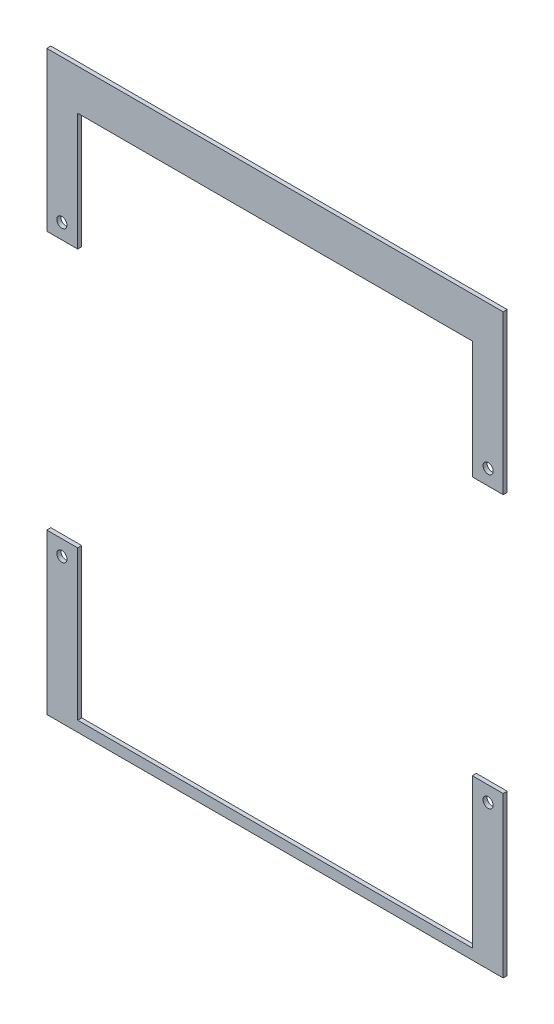
ISO-10303-21;
HEADER;
FILE_DESCRIPTION(('STEP AP214'),'2;1');
FILE_NAME('part.step','',(''),(''),'','','');
FILE_SCHEMA(('AUTOMOTIVE_DESIGN { 1 0 10303 214 1 1 1 1 }'));
ENDSEC;
DATA;
#1=APPLICATION_CONTEXT('core data for automotive mechanical design processes');
#2=APPLICATION_PROTOCOL_DEFINITION('international standard','automotive_design',2000,#1);
#3=PRODUCT_CONTEXT('',#1,'mechanical');
#4=PRODUCT('Part','Part','',(#3));
#5=PRODUCT_RELATED_PRODUCT_CATEGORY('part','',(#4));
#6=PRODUCT_DEFINITION_FORMATION('','',#4);
#7=PRODUCT_DEFINITION_CONTEXT('part definition',#1,'design');
#8=PRODUCT_DEFINITION('design','',#6,#7);
#9=PRODUCT_DEFINITION_SHAPE('','',#8);
#10=(LENGTH_UNIT() NAMED_UNIT(*) SI_UNIT(.MILLI.,.METRE.));
#11=(NAMED_UNIT(*) PLANE_ANGLE_UNIT() SI_UNIT($,.RADIAN.));
#12=(NAMED_UNIT(*) SI_UNIT($,.STERADIAN.) SOLID_ANGLE_UNIT());
#13=UNCERTAINTY_MEASURE_WITH_UNIT(LENGTH_MEASURE(1.E-05),#10,'distance_accuracy_value','');
#14=(GEOMETRIC_REPRESENTATION_CONTEXT(3) GLOBAL_UNCERTAINTY_ASSIGNED_CONTEXT((#13)) GLOBAL_UNIT_ASSIGNED_CONTEXT((#10,
#11,#12)) REPRESENTATION_CONTEXT('',''));
#15=CARTESIAN_POINT('',(0.,0.,0.));
#16=DIRECTION('',(0.,0.,1.));
#17=DIRECTION('',(1.,0.,0.));
#18=AXIS2_PLACEMENT_3D('',#15,#16,#17);
#19=CARTESIAN_POINT('',(0.,-44.6224,1.5875));
#20=DIRECTION('',(0.,1.,0.));
#21=DIRECTION('',(0.,0.,1.));
#22=AXIS2_PLACEMENT_3D('',#19,#20,#21);
#23=PLANE('',#22);
#24=DIRECTION('',(1.,0.,0.));
#25=VECTOR('',#24,1.);
#26=CARTESIAN_POINT('',(0.,-44.6224,0.));
#27=LINE('',#26,#25);
#28=CARTESIAN_POINT('',(-89.6514,-44.6224,0.));
#29=VERTEX_POINT('',#28);
#30=CARTESIAN_POINT('',(-77.5,-44.6224,0.));
#31=VERTEX_POINT('',#30);
#32=EDGE_CURVE('E179',#29,#31,#27,.T.);
#33=ORIENTED_EDGE('',*,*,#32,.F.);
#34=DIRECTION('',(0.,0.,-1.));
#35=VECTOR('',#34,1.);
#36=CARTESIAN_POINT('',(-89.6514,-44.6224,1.5875));
#37=LINE('',#36,#35);
#38=CARTESIAN_POINT('',(-89.6514,-44.6224,1.5875));
#39=VERTEX_POINT('',#38);
#40=EDGE_CURVE('E12',#39,#29,#37,.T.);
#41=ORIENTED_EDGE('',*,*,#40,.F.);
#42=DIRECTION('',(1.,0.,0.));
#43=VECTOR('',#42,1.);
#44=CARTESIAN_POINT('',(0.,-44.6224,1.5875));
#45=LINE('',#44,#43);
#46=CARTESIAN_POINT('',(-77.5,-44.6224,1.5875));
#47=VERTEX_POINT('',#46);
#48=EDGE_CURVE('E167',#39,#47,#45,.T.);
#49=ORIENTED_EDGE('',*,*,#48,.T.);
#50=DIRECTION('',(0.,0.,-1.));
#51=VECTOR('',#50,1.);
#52=CARTESIAN_POINT('',(-77.5,-44.6224,1.5875));
#53=LINE('',#52,#51);
#54=EDGE_CURVE('E64',#47,#31,#53,.T.);
#55=ORIENTED_EDGE('',*,*,#54,.T.);
#56=EDGE_LOOP('',(#33,#41,#49,#55));
#57=FACE_BOUND('',#56,.T.);
#58=ADVANCED_FACE('F47',(#57),#23,.T.);
#59=CARTESIAN_POINT('',(-89.6514,0.,1.5875));
#60=DIRECTION('',(1.,0.,0.));
#61=DIRECTION('',(0.,1.,0.));
#62=AXIS2_PLACEMENT_3D('',#59,#60,#61);
#63=PLANE('',#62);
#64=DIRECTION('',(0.,-1.,0.));
#65=VECTOR('',#64,1.);
#66=CARTESIAN_POINT('',(-89.6514,0.,0.));
#67=LINE('',#66,#65);
#68=CARTESIAN_POINT('',(-89.6514,-107.38,0.));
#69=VERTEX_POINT('',#68);
#70=EDGE_CURVE('E181',#29,#69,#67,.T.);
#71=ORIENTED_EDGE('',*,*,#70,.T.);
#72=DIRECTION('',(0.,0.,-1.));
#73=VECTOR('',#72,1.);
#74=CARTESIAN_POINT('',(-89.6514,-107.38,1.5875));
#75=LINE('',#74,#73);
#76=CARTESIAN_POINT('',(-89.6514,-107.38,1.5875));
#77=VERTEX_POINT('',#76);
#78=EDGE_CURVE('E56',#77,#69,#75,.T.);
#79=ORIENTED_EDGE('',*,*,#78,.F.);
#80=DIRECTION('',(0.,-1.,0.));
#81=VECTOR('',#80,1.);
#82=CARTESIAN_POINT('',(-89.6514,0.,1.5875));
#83=LINE('',#82,#81);
#84=EDGE_CURVE('E170',#39,#77,#83,.T.);
#85=ORIENTED_EDGE('',*,*,#84,.F.);
#86=ORIENTED_EDGE('',*,*,#40,.T.);
#87=EDGE_LOOP('',(#71,#79,#85,#86));
#88=FACE_BOUND('',#87,.T.);
#89=ADVANCED_FACE('F197',(#88),#63,.F.);
#90=CARTESIAN_POINT('',(0.,-107.38,1.5875));
#91=DIRECTION('',(0.,1.,0.));
#92=DIRECTION('',(0.,0.,1.));
#93=AXIS2_PLACEMENT_3D('',#90,#91,#92);
#94=PLANE('',#93);
#95=DIRECTION('',(1.,0.,0.));
#96=VECTOR('',#95,1.);
#97=CARTESIAN_POINT('',(0.,-107.38,0.));
#98=LINE('',#97,#96);
#99=CARTESIAN_POINT('',(89.6514,-107.38,0.));
#100=VERTEX_POINT('',#99);
#101=EDGE_CURVE('E184',#69,#100,#98,.T.);
#102=ORIENTED_EDGE('',*,*,#101,.T.);
#103=DIRECTION('',(0.,0.,-1.));
#104=VECTOR('',#103,1.);
#105=CARTESIAN_POINT('',(89.6514,-107.38,1.5875));
#106=LINE('',#105,#104);
#107=CARTESIAN_POINT('',(89.6514,-107.38,1.5875));
#108=VERTEX_POINT('',#107);
#109=EDGE_CURVE('E139',#108,#100,#106,.T.);
#110=ORIENTED_EDGE('',*,*,#109,.F.);
#111=DIRECTION('',(1.,0.,0.));
#112=VECTOR('',#111,1.);
#113=CARTESIAN_POINT('',(0.,-107.38,1.5875));
#114=LINE('',#113,#112);
#115=EDGE_CURVE('E124',#77,#108,#114,.T.);
#116=ORIENTED_EDGE('',*,*,#115,.F.);
#117=ORIENTED_EDGE('',*,*,#78,.T.);
#118=EDGE_LOOP('',(#102,#110,#116,#117));
#119=FACE_BOUND('',#118,.T.);
#120=ADVANCED_FACE('F194',(#119),#94,.F.);
#121=CARTESIAN_POINT('',(0.,-103.25,1.5875));
#122=DIRECTION('',(0.,1.,0.));
#123=DIRECTION('',(0.,0.,1.));
#124=AXIS2_PLACEMENT_3D('',#121,#122,#123);
#125=PLANE('',#124);
#126=DIRECTION('',(1.,0.,0.));
#127=VECTOR('',#126,1.);
#128=CARTESIAN_POINT('',(0.,-103.25,0.));
#129=LINE('',#128,#127);
#130=CARTESIAN_POINT('',(-77.5,-103.25,0.));
#131=VERTEX_POINT('',#130);
#132=CARTESIAN_POINT('',(77.5,-103.25,0.));
#133=VERTEX_POINT('',#132);
#134=EDGE_CURVE('E186',#131,#133,#129,.T.);
#135=ORIENTED_EDGE('',*,*,#134,.F.);
#136=DIRECTION('',(0.,0.,-1.));
#137=VECTOR('',#136,1.);
#138=CARTESIAN_POINT('',(-77.5,-103.25,1.5875));
#139=LINE('',#138,#137);
#140=CARTESIAN_POINT('',(-77.5,-103.25,1.5875));
#141=VERTEX_POINT('',#140);
#142=EDGE_CURVE('E78',#141,#131,#139,.T.);
#143=ORIENTED_EDGE('',*,*,#142,.F.);
#144=DIRECTION('',(1.,0.,0.));
#145=VECTOR('',#144,1.);
#146=CARTESIAN_POINT('',(0.,-103.25,1.5875));
#147=LINE('',#146,#145);
#148=CARTESIAN_POINT('',(77.5,-103.25,1.5875));
#149=VERTEX_POINT('',#148);
#150=EDGE_CURVE('E173',#141,#149,#147,.T.);
#151=ORIENTED_EDGE('',*,*,#150,.T.);
#152=DIRECTION('',(0.,0.,-1.));
#153=VECTOR('',#152,1.);
#154=CARTESIAN_POINT('',(77.5,-103.25,1.5875));
#155=LINE('',#154,#153);
#156=EDGE_CURVE('E160',#149,#133,#155,.T.);
#157=ORIENTED_EDGE('',*,*,#156,.T.);
#158=EDGE_LOOP('',(#135,#143,#151,#157));
#159=FACE_BOUND('',#158,.T.);
#160=ADVANCED_FACE('F209',(#159),#125,.T.);
#161=CARTESIAN_POINT('',(-83.72,-50.6224,1.5875));
#162=DIRECTION('',(0.,0.,-1.));
#163=DIRECTION('',(-1.,0.,0.));
#164=AXIS2_PLACEMENT_3D('',#161,#162,#163);
#165=CYLINDRICAL_SURFACE('',#164,2.);
#166=CARTESIAN_POINT('',(-83.72,-50.6224,1.5875));
#167=DIRECTION('',(0.,0.,1.));
#168=DIRECTION('',(1.,0.,0.));
#169=AXIS2_PLACEMENT_3D('',#166,#167,#168);
#170=CIRCLE('',#169,2.);
#171=CARTESIAN_POINT('',(-81.72,-50.6224,1.5875));
#172=VERTEX_POINT('',#171);
#173=EDGE_CURVE('E164',#172,#172,#170,.T.);
#174=ORIENTED_EDGE('',*,*,#173,.T.);
#175=EDGE_LOOP('',(#174));
#176=FACE_BOUND('',#175,.T.);
#177=CARTESIAN_POINT('',(-83.72,-50.6224,0.));
#178=DIRECTION('',(0.,0.,1.));
#179=DIRECTION('',(1.,0.,0.));
#180=AXIS2_PLACEMENT_3D('',#177,#178,#179);
#181=CIRCLE('',#180,2.);
#182=CARTESIAN_POINT('',(-81.72,-50.6224,0.));
#183=VERTEX_POINT('',#182);
#184=EDGE_CURVE('E138',#183,#183,#181,.T.);
#185=ORIENTED_EDGE('',*,*,#184,.F.);
#186=EDGE_LOOP('',(#185));
#187=FACE_BOUND('',#186,.T.);
#188=ADVANCED_FACE('F49',(#176,#187),#165,.F.);
#189=CARTESIAN_POINT('',(-77.5,0.,1.5875));
#190=DIRECTION('',(1.,0.,0.));
#191=DIRECTION('',(0.,1.,0.));
#192=AXIS2_PLACEMENT_3D('',#189,#190,#191);
#193=PLANE('',#192);
#194=DIRECTION('',(0.,-1.,0.));
#195=VECTOR('',#194,1.);
#196=CARTESIAN_POINT('',(-77.5,0.,0.));
#197=LINE('',#196,#195);
#198=EDGE_CURVE('E168',#31,#131,#197,.T.);
#199=ORIENTED_EDGE('',*,*,#198,.F.);
#200=ORIENTED_EDGE('',*,*,#54,.F.);
#201=DIRECTION('',(0.,-1.,0.));
#202=VECTOR('',#201,1.);
#203=CARTESIAN_POINT('',(-77.5,0.,1.5875));
#204=LINE('',#203,#202);
#205=EDGE_CURVE('E175',#47,#141,#204,.T.);
#206=ORIENTED_EDGE('',*,*,#205,.T.);
#207=ORIENTED_EDGE('',*,*,#142,.T.);
#208=EDGE_LOOP('',(#199,#200,#206,#207));
#209=FACE_BOUND('',#208,.T.);
#210=ADVANCED_FACE('F213',(#209),#193,.T.);
#211=CARTESIAN_POINT('',(0.,0.,1.5875));
#212=DIRECTION('',(0.,0.,1.));
#213=DIRECTION('',(1.,0.,0.));
#214=AXIS2_PLACEMENT_3D('',#211,#212,#213);
#215=PLANE('',#214);
#216=ORIENTED_EDGE('',*,*,#173,.F.);
#217=EDGE_LOOP('',(#216));
#218=FACE_BOUND('',#217,.T.);
#219=ORIENTED_EDGE('',*,*,#48,.F.);
#220=ORIENTED_EDGE('',*,*,#84,.T.);
#221=ORIENTED_EDGE('',*,*,#115,.T.);
#222=DIRECTION('',(0.,-1.,0.));
#223=VECTOR('',#222,1.);
#224=CARTESIAN_POINT('',(89.6514,0.,1.5875));
#225=LINE('',#224,#223);
#226=CARTESIAN_POINT('',(89.6514,-44.6224,1.5875));
#227=VERTEX_POINT('',#226);
#228=EDGE_CURVE('E114',#227,#108,#225,.T.);
#229=ORIENTED_EDGE('',*,*,#228,.F.);
#230=DIRECTION('',(-1.,0.,0.));
#231=VECTOR('',#230,1.);
#232=CARTESIAN_POINT('',(0.,-44.6224,1.5875));
#233=LINE('',#232,#231);
#234=CARTESIAN_POINT('',(77.5,-44.6224,1.5875));
#235=VERTEX_POINT('',#234);
#236=EDGE_CURVE('E121',#227,#235,#233,.T.);
#237=ORIENTED_EDGE('',*,*,#236,.T.);
#238=DIRECTION('',(0.,-1.,0.));
#239=VECTOR('',#238,1.);
#240=CARTESIAN_POINT('',(77.5,0.,1.5875));
#241=LINE('',#240,#239);
#242=EDGE_CURVE('E128',#235,#149,#241,.T.);
#243=ORIENTED_EDGE('',*,*,#242,.T.);
#244=ORIENTED_EDGE('',*,*,#150,.F.);
#245=ORIENTED_EDGE('',*,*,#205,.F.);
#246=EDGE_LOOP('',(#219,#220,#221,#229,#237,#243,#244,#245));
#247=FACE_BOUND('',#246,.T.);
#248=CARTESIAN_POINT('',(83.72,-50.6224,1.5875));
#249=DIRECTION('',(0.,0.,-1.));
#250=DIRECTION('',(-1.,0.,0.));
#251=AXIS2_PLACEMENT_3D('',#248,#249,#250);
#252=CIRCLE('',#251,2.);
#253=CARTESIAN_POINT('',(81.72,-50.6224,1.5875));
#254=VERTEX_POINT('',#253);
#255=EDGE_CURVE('E144',#254,#254,#252,.T.);
#256=ORIENTED_EDGE('',*,*,#255,.T.);
#257=EDGE_LOOP('',(#256));
#258=FACE_BOUND('',#257,.T.);
#259=ADVANCED_FACE('F117',(#218,#247,#258),#215,.T.);
#260=CARTESIAN_POINT('',(0.,0.,0.));
#261=DIRECTION('',(0.,0.,1.));
#262=DIRECTION('',(1.,0.,0.));
#263=AXIS2_PLACEMENT_3D('',#260,#261,#262);
#264=PLANE('',#263);
#265=ORIENTED_EDGE('',*,*,#184,.T.);
#266=EDGE_LOOP('',(#265));
#267=FACE_BOUND('',#266,.T.);
#268=ORIENTED_EDGE('',*,*,#32,.T.);
#269=ORIENTED_EDGE('',*,*,#198,.T.);
#270=ORIENTED_EDGE('',*,*,#134,.T.);
#271=DIRECTION('',(0.,-1.,0.));
#272=VECTOR('',#271,1.);
#273=CARTESIAN_POINT('',(77.5,0.,0.));
#274=LINE('',#273,#272);
#275=CARTESIAN_POINT('',(77.5,-44.6224,0.));
#276=VERTEX_POINT('',#275);
#277=EDGE_CURVE('E147',#276,#133,#274,.T.);
#278=ORIENTED_EDGE('',*,*,#277,.F.);
#279=DIRECTION('',(-1.,0.,0.));
#280=VECTOR('',#279,1.);
#281=CARTESIAN_POINT('',(0.,-44.6224,0.));
#282=LINE('',#281,#280);
#283=CARTESIAN_POINT('',(89.6514,-44.6224,0.));
#284=VERTEX_POINT('',#283);
#285=EDGE_CURVE('E154',#284,#276,#282,.T.);
#286=ORIENTED_EDGE('',*,*,#285,.F.);
#287=DIRECTION('',(0.,-1.,0.));
#288=VECTOR('',#287,1.);
#289=CARTESIAN_POINT('',(89.6514,0.,0.));
#290=LINE('',#289,#288);
#291=EDGE_CURVE('E134',#284,#100,#290,.T.);
#292=ORIENTED_EDGE('',*,*,#291,.T.);
#293=ORIENTED_EDGE('',*,*,#101,.F.);
#294=ORIENTED_EDGE('',*,*,#70,.F.);
#295=EDGE_LOOP('',(#268,#269,#270,#278,#286,#292,#293,#294));
#296=FACE_BOUND('',#295,.T.);
#297=CARTESIAN_POINT('',(83.72,-50.6224,0.));
#298=DIRECTION('',(0.,0.,-1.));
#299=DIRECTION('',(-1.,0.,0.));
#300=AXIS2_PLACEMENT_3D('',#297,#298,#299);
#301=CIRCLE('',#300,2.);
#302=CARTESIAN_POINT('',(81.72,-50.6224,0.));
#303=VERTEX_POINT('',#302);
#304=EDGE_CURVE('E151',#303,#303,#301,.T.);
#305=ORIENTED_EDGE('',*,*,#304,.F.);
#306=EDGE_LOOP('',(#305));
#307=FACE_BOUND('',#306,.T.);
#308=ADVANCED_FACE('F199',(#267,#296,#307),#264,.F.);
#309=CARTESIAN_POINT('',(0.,-44.6224,1.5875));
#310=DIRECTION('',(0.,1.,0.));
#311=DIRECTION('',(0.,0.,1.));
#312=AXIS2_PLACEMENT_3D('',#309,#310,#311);
#313=PLANE('',#312);
#314=ORIENTED_EDGE('',*,*,#285,.T.);
#315=DIRECTION('',(0.,0.,-1.));
#316=VECTOR('',#315,1.);
#317=CARTESIAN_POINT('',(77.5,-44.6224,1.5875));
#318=LINE('',#317,#316);
#319=EDGE_CURVE('E143',#235,#276,#318,.T.);
#320=ORIENTED_EDGE('',*,*,#319,.F.);
#321=ORIENTED_EDGE('',*,*,#236,.F.);
#322=DIRECTION('',(0.,0.,-1.));
#323=VECTOR('',#322,1.);
#324=CARTESIAN_POINT('',(89.6514,-44.6224,1.5875));
#325=LINE('',#324,#323);
#326=EDGE_CURVE('E131',#227,#284,#325,.T.);
#327=ORIENTED_EDGE('',*,*,#326,.T.);
#328=EDGE_LOOP('',(#314,#320,#321,#327));
#329=FACE_BOUND('',#328,.T.);
#330=ADVANCED_FACE('F141',(#329),#313,.T.);
#331=CARTESIAN_POINT('',(89.6514,0.,1.5875));
#332=DIRECTION('',(-1.,0.,0.));
#333=DIRECTION('',(0.,1.,0.));
#334=AXIS2_PLACEMENT_3D('',#331,#332,#333);
#335=PLANE('',#334);
#336=ORIENTED_EDGE('',*,*,#291,.F.);
#337=ORIENTED_EDGE('',*,*,#326,.F.);
#338=ORIENTED_EDGE('',*,*,#228,.T.);
#339=ORIENTED_EDGE('',*,*,#109,.T.);
#340=EDGE_LOOP('',(#336,#337,#338,#339));
#341=FACE_BOUND('',#340,.T.);
#342=ADVANCED_FACE('F132',(#341),#335,.F.);
#343=CARTESIAN_POINT('',(83.72,-50.6224,1.5875));
#344=DIRECTION('',(0.,0.,-1.));
#345=DIRECTION('',(1.,0.,0.));
#346=AXIS2_PLACEMENT_3D('',#343,#344,#345);
#347=CYLINDRICAL_SURFACE('',#346,2.);
#348=ORIENTED_EDGE('',*,*,#255,.F.);
#349=EDGE_LOOP('',(#348));
#350=FACE_BOUND('',#349,.T.);
#351=ORIENTED_EDGE('',*,*,#304,.T.);
#352=EDGE_LOOP('',(#351));
#353=FACE_BOUND('',#352,.T.);
#354=ADVANCED_FACE('F222',(#350,#353),#347,.F.);
#355=CARTESIAN_POINT('',(77.5,0.,1.5875));
#356=DIRECTION('',(-1.,0.,0.));
#357=DIRECTION('',(0.,1.,0.));
#358=AXIS2_PLACEMENT_3D('',#355,#356,#357);
#359=PLANE('',#358);
#360=ORIENTED_EDGE('',*,*,#277,.T.);
#361=ORIENTED_EDGE('',*,*,#156,.F.);
#362=ORIENTED_EDGE('',*,*,#242,.F.);
#363=ORIENTED_EDGE('',*,*,#319,.T.);
#364=EDGE_LOOP('',(#360,#361,#362,#363));
#365=FACE_BOUND('',#364,.T.);
#366=ADVANCED_FACE('F225',(#365),#359,.T.);
#367=CLOSED_SHELL('',(#58,#89,#120,#160,#188,#210,#259,#308,#330,#342,#354,#366));
#368=MANIFOLD_SOLID_BREP('B2',#367);
#369=CARTESIAN_POINT('',(-89.6514,0.,1.5875));
#370=DIRECTION('',(1.,0.,0.));
#371=DIRECTION('',(0.,1.,0.));
#372=AXIS2_PLACEMENT_3D('',#369,#370,#371);
#373=PLANE('',#372);
#374=DIRECTION('',(0.,-1.,0.));
#375=VECTOR('',#374,1.);
#376=CARTESIAN_POINT('',(-89.6514,0.,0.));
#377=LINE('',#376,#375);
#378=CARTESIAN_POINT('',(-89.6514,119.25,0.));
#379=VERTEX_POINT('',#378);
#380=CARTESIAN_POINT('',(-89.6514,57.03,0.));
#381=VERTEX_POINT('',#380);
#382=EDGE_CURVE('E452',#379,#381,#377,.T.);
#383=ORIENTED_EDGE('',*,*,#382,.T.);
#384=DIRECTION('',(0.,0.,-1.));
#385=VECTOR('',#384,1.);
#386=CARTESIAN_POINT('',(-89.6514,57.03,1.5875));
#387=LINE('',#386,#385);
#388=CARTESIAN_POINT('',(-89.6514,57.03,1.5875));
#389=VERTEX_POINT('',#388);
#390=EDGE_CURVE('E45',#389,#381,#387,.T.);
#391=ORIENTED_EDGE('',*,*,#390,.F.);
#392=DIRECTION('',(0.,-1.,0.));
#393=VECTOR('',#392,1.);
#394=CARTESIAN_POINT('',(-89.6514,0.,1.5875));
#395=LINE('',#394,#393);
#396=CARTESIAN_POINT('',(-89.6514,119.25,1.5875));
#397=VERTEX_POINT('',#396);
#398=EDGE_CURVE('E439',#397,#389,#395,.T.);
#399=ORIENTED_EDGE('',*,*,#398,.F.);
#400=DIRECTION('',(0.,0.,-1.));
#401=VECTOR('',#400,1.);
#402=CARTESIAN_POINT('',(-89.6514,119.25,1.5875));
#403=LINE('',#402,#401);
#404=EDGE_CURVE('E334',#397,#379,#403,.T.);
#405=ORIENTED_EDGE('',*,*,#404,.T.);
#406=EDGE_LOOP('',(#383,#391,#399,#405));
#407=FACE_BOUND('',#406,.T.);
#408=ADVANCED_FACE('F317',(#407),#373,.F.);
#409=CARTESIAN_POINT('',(0.,57.03,1.5875));
#410=DIRECTION('',(0.,1.,0.));
#411=DIRECTION('',(0.,0.,1.));
#412=AXIS2_PLACEMENT_3D('',#409,#410,#411);
#413=PLANE('',#412);
#414=DIRECTION('',(1.,0.,0.));
#415=VECTOR('',#414,1.);
#416=CARTESIAN_POINT('',(0.,57.03,0.));
#417=LINE('',#416,#415);
#418=CARTESIAN_POINT('',(-77.5,57.03,0.));
#419=VERTEX_POINT('',#418);
#420=EDGE_CURVE('E454',#381,#419,#417,.T.);
#421=ORIENTED_EDGE('',*,*,#420,.T.);
#422=DIRECTION('',(0.,0.,-1.));
#423=VECTOR('',#422,1.);
#424=CARTESIAN_POINT('',(-77.5,57.03,1.5875));
#425=LINE('',#424,#423);
#426=CARTESIAN_POINT('',(-77.5,57.03,1.5875));
#427=VERTEX_POINT('',#426);
#428=EDGE_CURVE('E326',#427,#419,#425,.T.);
#429=ORIENTED_EDGE('',*,*,#428,.F.);
#430=DIRECTION('',(1.,0.,0.));
#431=VECTOR('',#430,1.);
#432=CARTESIAN_POINT('',(0.,57.03,1.5875));
#433=LINE('',#432,#431);
#434=EDGE_CURVE('E363',#389,#427,#433,.T.);
#435=ORIENTED_EDGE('',*,*,#434,.F.);
#436=ORIENTED_EDGE('',*,*,#390,.T.);
#437=EDGE_LOOP('',(#421,#429,#435,#436));
#438=FACE_BOUND('',#437,.T.);
#439=ADVANCED_FACE('F468',(#438),#413,.F.);
#440=CARTESIAN_POINT('',(-77.5,0.,1.5875));
#441=DIRECTION('',(1.,0.,0.));
#442=DIRECTION('',(0.,1.,0.));
#443=AXIS2_PLACEMENT_3D('',#440,#441,#442);
#444=PLANE('',#443);
#445=DIRECTION('',(0.,-1.,0.));
#446=VECTOR('',#445,1.);
#447=CARTESIAN_POINT('',(-77.5,0.,0.));
#448=LINE('',#447,#446);
#449=CARTESIAN_POINT('',(-77.5,103.25,0.));
#450=VERTEX_POINT('',#449);
#451=EDGE_CURVE('E457',#450,#419,#448,.T.);
#452=ORIENTED_EDGE('',*,*,#451,.F.);
#453=DIRECTION('',(0.,0.,-1.));
#454=VECTOR('',#453,1.);
#455=CARTESIAN_POINT('',(-77.5,103.25,1.5875));
#456=LINE('',#455,#454);
#457=CARTESIAN_POINT('',(-77.5,103.25,1.5875));
#458=VERTEX_POINT('',#457);
#459=EDGE_CURVE('E352',#458,#450,#456,.T.);
#460=ORIENTED_EDGE('',*,*,#459,.F.);
#461=DIRECTION('',(0.,-1.,0.));
#462=VECTOR('',#461,1.);
#463=CARTESIAN_POINT('',(-77.5,0.,1.5875));
#464=LINE('',#463,#462);
#465=EDGE_CURVE('E443',#458,#427,#464,.T.);
#466=ORIENTED_EDGE('',*,*,#465,.T.);
#467=ORIENTED_EDGE('',*,*,#428,.T.);
#468=EDGE_LOOP('',(#452,#460,#466,#467));
#469=FACE_BOUND('',#468,.T.);
#470=ADVANCED_FACE('F466',(#469),#444,.T.);
#471=CARTESIAN_POINT('',(0.,103.25,1.5875));
#472=DIRECTION('',(0.,1.,0.));
#473=DIRECTION('',(0.,0.,1.));
#474=AXIS2_PLACEMENT_3D('',#471,#472,#473);
#475=PLANE('',#474);
#476=DIRECTION('',(1.,0.,0.));
#477=VECTOR('',#476,1.);
#478=CARTESIAN_POINT('',(0.,103.25,0.));
#479=LINE('',#478,#477);
#480=CARTESIAN_POINT('',(77.5,103.25,0.));
#481=VERTEX_POINT('',#480);
#482=EDGE_CURVE('E460',#450,#481,#479,.T.);
#483=ORIENTED_EDGE('',*,*,#482,.T.);
#484=DIRECTION('',(0.,0.,-1.));
#485=VECTOR('',#484,1.);
#486=CARTESIAN_POINT('',(77.5,103.25,1.5875));
#487=LINE('',#486,#485);
#488=CARTESIAN_POINT('',(77.5,103.25,1.5875));
#489=VERTEX_POINT('',#488);
#490=EDGE_CURVE('E432',#489,#481,#487,.T.);
#491=ORIENTED_EDGE('',*,*,#490,.F.);
#492=DIRECTION('',(1.,0.,0.));
#493=VECTOR('',#492,1.);
#494=CARTESIAN_POINT('',(0.,103.25,1.5875));
#495=LINE('',#494,#493);
#496=EDGE_CURVE('E446',#458,#489,#495,.T.);
#497=ORIENTED_EDGE('',*,*,#496,.F.);
#498=ORIENTED_EDGE('',*,*,#459,.T.);
#499=EDGE_LOOP('',(#483,#491,#497,#498));
#500=FACE_BOUND('',#499,.T.);
#501=ADVANCED_FACE('F475',(#500),#475,.F.);
#502=CARTESIAN_POINT('',(-83.72,63.03,1.5875));
#503=DIRECTION('',(0.,0.,-1.));
#504=DIRECTION('',(-1.,0.,0.));
#505=AXIS2_PLACEMENT_3D('',#502,#503,#504);
#506=CYLINDRICAL_SURFACE('',#505,2.);
#507=CARTESIAN_POINT('',(-83.72,63.03,1.5875));
#508=DIRECTION('',(0.,0.,1.));
#509=DIRECTION('',(1.,0.,0.));
#510=AXIS2_PLACEMENT_3D('',#507,#508,#509);
#511=CIRCLE('',#510,2.);
#512=CARTESIAN_POINT('',(-81.72,63.03,1.5875));
#513=VERTEX_POINT('',#512);
#514=EDGE_CURVE('E436',#513,#513,#511,.T.);
#515=ORIENTED_EDGE('',*,*,#514,.T.);
#516=EDGE_LOOP('',(#515));
#517=FACE_BOUND('',#516,.T.);
#518=CARTESIAN_POINT('',(-83.72,63.03,0.));
#519=DIRECTION('',(0.,0.,1.));
#520=DIRECTION('',(1.,0.,0.));
#521=AXIS2_PLACEMENT_3D('',#518,#519,#520);
#522=CIRCLE('',#521,2.);
#523=CARTESIAN_POINT('',(-81.72,63.03,0.));
#524=VERTEX_POINT('',#523);
#525=EDGE_CURVE('E411',#524,#524,#522,.T.);
#526=ORIENTED_EDGE('',*,*,#525,.F.);
#527=EDGE_LOOP('',(#526));
#528=FACE_BOUND('',#527,.T.);
#529=ADVANCED_FACE('F319',(#517,#528),#506,.F.);
#530=CARTESIAN_POINT('',(0.,119.25,1.5875));
#531=DIRECTION('',(0.,1.,0.));
#532=DIRECTION('',(0.,0.,1.));
#533=AXIS2_PLACEMENT_3D('',#530,#531,#532);
#534=PLANE('',#533);
#535=DIRECTION('',(1.,0.,0.));
#536=VECTOR('',#535,1.);
#537=CARTESIAN_POINT('',(0.,119.25,0.));
#538=LINE('',#537,#536);
#539=CARTESIAN_POINT('',(89.6514,119.25,0.));
#540=VERTEX_POINT('',#539);
#541=EDGE_CURVE('E440',#379,#540,#538,.T.);
#542=ORIENTED_EDGE('',*,*,#541,.F.);
#543=ORIENTED_EDGE('',*,*,#404,.F.);
#544=DIRECTION('',(1.,0.,0.));
#545=VECTOR('',#544,1.);
#546=CARTESIAN_POINT('',(0.,119.25,1.5875));
#547=LINE('',#546,#545);
#548=CARTESIAN_POINT('',(89.6514,119.25,1.5875));
#549=VERTEX_POINT('',#548);
#550=EDGE_CURVE('E448',#397,#549,#547,.T.);
#551=ORIENTED_EDGE('',*,*,#550,.T.);
#552=DIRECTION('',(0.,0.,-1.));
#553=VECTOR('',#552,1.);
#554=CARTESIAN_POINT('',(89.6514,119.25,1.5875));
#555=LINE('',#554,#553);
#556=EDGE_CURVE('E416',#549,#540,#555,.T.);
#557=ORIENTED_EDGE('',*,*,#556,.T.);
#558=EDGE_LOOP('',(#542,#543,#551,#557));
#559=FACE_BOUND('',#558,.T.);
#560=ADVANCED_FACE('F478',(#559),#534,.T.);
#561=CARTESIAN_POINT('',(0.,0.,1.5875));
#562=DIRECTION('',(0.,0.,1.));
#563=DIRECTION('',(1.,0.,0.));
#564=AXIS2_PLACEMENT_3D('',#561,#562,#563);
#565=PLANE('',#564);
#566=ORIENTED_EDGE('',*,*,#514,.F.);
#567=EDGE_LOOP('',(#566));
#568=FACE_BOUND('',#567,.T.);
#569=ORIENTED_EDGE('',*,*,#398,.T.);
#570=ORIENTED_EDGE('',*,*,#434,.T.);
#571=ORIENTED_EDGE('',*,*,#465,.F.);
#572=ORIENTED_EDGE('',*,*,#496,.T.);
#573=DIRECTION('',(0.,-1.,0.));
#574=VECTOR('',#573,1.);
#575=CARTESIAN_POINT('',(77.5,0.,1.5875));
#576=LINE('',#575,#574);
#577=CARTESIAN_POINT('',(77.5,57.03,1.5875));
#578=VERTEX_POINT('',#577);
#579=EDGE_CURVE('E398',#489,#578,#576,.T.);
#580=ORIENTED_EDGE('',*,*,#579,.T.);
#581=DIRECTION('',(-1.,0.,0.));
#582=VECTOR('',#581,1.);
#583=CARTESIAN_POINT('',(0.,57.03,1.5875));
#584=LINE('',#583,#582);
#585=CARTESIAN_POINT('',(89.6514,57.03,1.5875));
#586=VERTEX_POINT('',#585);
#587=EDGE_CURVE('E389',#586,#578,#584,.T.);
#588=ORIENTED_EDGE('',*,*,#587,.F.);
#589=DIRECTION('',(0.,-1.,0.));
#590=VECTOR('',#589,1.);
#591=CARTESIAN_POINT('',(89.6514,0.,1.5875));
#592=LINE('',#591,#590);
#593=EDGE_CURVE('E395',#549,#586,#592,.T.);
#594=ORIENTED_EDGE('',*,*,#593,.F.);
#595=ORIENTED_EDGE('',*,*,#550,.F.);
#596=EDGE_LOOP('',(#569,#570,#571,#572,#580,#588,#594,#595));
#597=FACE_BOUND('',#596,.T.);
#598=CARTESIAN_POINT('',(83.72,63.03,1.5875));
#599=DIRECTION('',(0.,0.,-1.));
#600=DIRECTION('',(-1.,0.,0.));
#601=AXIS2_PLACEMENT_3D('',#598,#599,#600);
#602=CIRCLE('',#601,2.);
#603=CARTESIAN_POINT('',(81.72,63.03,1.5875));
#604=VERTEX_POINT('',#603);
#605=EDGE_CURVE('E417',#604,#604,#602,.T.);
#606=ORIENTED_EDGE('',*,*,#605,.T.);
#607=EDGE_LOOP('',(#606));
#608=FACE_BOUND('',#607,.T.);
#609=ADVANCED_FACE('F391',(#568,#597,#608),#565,.T.);
#610=CARTESIAN_POINT('',(0.,0.,0.));
#611=DIRECTION('',(0.,0.,1.));
#612=DIRECTION('',(1.,0.,0.));
#613=AXIS2_PLACEMENT_3D('',#610,#611,#612);
#614=PLANE('',#613);
#615=ORIENTED_EDGE('',*,*,#525,.T.);
#616=EDGE_LOOP('',(#615));
#617=FACE_BOUND('',#616,.T.);
#618=ORIENTED_EDGE('',*,*,#382,.F.);
#619=ORIENTED_EDGE('',*,*,#541,.T.);
#620=DIRECTION('',(0.,-1.,0.));
#621=VECTOR('',#620,1.);
#622=CARTESIAN_POINT('',(89.6514,0.,0.));
#623=LINE('',#622,#621);
#624=CARTESIAN_POINT('',(89.6514,57.03,0.));
#625=VERTEX_POINT('',#624);
#626=EDGE_CURVE('E427',#540,#625,#623,.T.);
#627=ORIENTED_EDGE('',*,*,#626,.T.);
#628=DIRECTION('',(-1.,0.,0.));
#629=VECTOR('',#628,1.);
#630=CARTESIAN_POINT('',(0.,57.03,0.));
#631=LINE('',#630,#629);
#632=CARTESIAN_POINT('',(77.5,57.03,0.));
#633=VERTEX_POINT('',#632);
#634=EDGE_CURVE('E407',#625,#633,#631,.T.);
#635=ORIENTED_EDGE('',*,*,#634,.T.);
#636=DIRECTION('',(0.,-1.,0.));
#637=VECTOR('',#636,1.);
#638=CARTESIAN_POINT('',(77.5,0.,0.));
#639=LINE('',#638,#637);
#640=EDGE_CURVE('E420',#481,#633,#639,.T.);
#641=ORIENTED_EDGE('',*,*,#640,.F.);
#642=ORIENTED_EDGE('',*,*,#482,.F.);
#643=ORIENTED_EDGE('',*,*,#451,.T.);
#644=ORIENTED_EDGE('',*,*,#420,.F.);
#645=EDGE_LOOP('',(#618,#619,#627,#635,#641,#642,#643,#644));
#646=FACE_BOUND('',#645,.T.);
#647=CARTESIAN_POINT('',(83.72,63.03,0.));
#648=DIRECTION('',(0.,0.,-1.));
#649=DIRECTION('',(-1.,0.,0.));
#650=AXIS2_PLACEMENT_3D('',#647,#648,#649);
#651=CIRCLE('',#650,2.);
#652=CARTESIAN_POINT('',(81.72,63.03,0.));
#653=VERTEX_POINT('',#652);
#654=EDGE_CURVE('E424',#653,#653,#651,.T.);
#655=ORIENTED_EDGE('',*,*,#654,.F.);
#656=EDGE_LOOP('',(#655));
#657=FACE_BOUND('',#656,.T.);
#658=ADVANCED_FACE('F471',(#617,#646,#657),#614,.F.);
#659=CARTESIAN_POINT('',(89.6514,0.,1.5875));
#660=DIRECTION('',(-1.,0.,0.));
#661=DIRECTION('',(0.,1.,0.));
#662=AXIS2_PLACEMENT_3D('',#659,#660,#661);
#663=PLANE('',#662);
#664=ORIENTED_EDGE('',*,*,#626,.F.);
#665=ORIENTED_EDGE('',*,*,#556,.F.);
#666=ORIENTED_EDGE('',*,*,#593,.T.);
#667=DIRECTION('',(0.,0.,-1.));
#668=VECTOR('',#667,1.);
#669=CARTESIAN_POINT('',(89.6514,57.03,1.5875));
#670=LINE('',#669,#668);
#671=EDGE_CURVE('E404',#586,#625,#670,.T.);
#672=ORIENTED_EDGE('',*,*,#671,.T.);
#673=EDGE_LOOP('',(#664,#665,#666,#672));
#674=FACE_BOUND('',#673,.T.);
#675=ADVANCED_FACE('F414',(#674),#663,.F.);
#676=CARTESIAN_POINT('',(0.,57.03,1.5875));
#677=DIRECTION('',(0.,1.,0.));
#678=DIRECTION('',(0.,0.,1.));
#679=AXIS2_PLACEMENT_3D('',#676,#677,#678);
#680=PLANE('',#679);
#681=ORIENTED_EDGE('',*,*,#634,.F.);
#682=ORIENTED_EDGE('',*,*,#671,.F.);
#683=ORIENTED_EDGE('',*,*,#587,.T.);
#684=DIRECTION('',(0.,0.,-1.));
#685=VECTOR('',#684,1.);
#686=CARTESIAN_POINT('',(77.5,57.03,1.5875));
#687=LINE('',#686,#685);
#688=EDGE_CURVE('E412',#578,#633,#687,.T.);
#689=ORIENTED_EDGE('',*,*,#688,.T.);
#690=EDGE_LOOP('',(#681,#682,#683,#689));
#691=FACE_BOUND('',#690,.T.);
#692=ADVANCED_FACE('F405',(#691),#680,.F.);
#693=CARTESIAN_POINT('',(77.5,0.,1.5875));
#694=DIRECTION('',(-1.,0.,0.));
#695=DIRECTION('',(0.,1.,0.));
#696=AXIS2_PLACEMENT_3D('',#693,#694,#695);
#697=PLANE('',#696);
#698=ORIENTED_EDGE('',*,*,#640,.T.);
#699=ORIENTED_EDGE('',*,*,#688,.F.);
#700=ORIENTED_EDGE('',*,*,#579,.F.);
#701=ORIENTED_EDGE('',*,*,#490,.T.);
#702=EDGE_LOOP('',(#698,#699,#700,#701));
#703=FACE_BOUND('',#702,.T.);
#704=ADVANCED_FACE('F477',(#703),#697,.T.);
#705=CARTESIAN_POINT('',(83.72,63.03,1.5875));
#706=DIRECTION('',(0.,0.,-1.));
#707=DIRECTION('',(1.,0.,0.));
#708=AXIS2_PLACEMENT_3D('',#705,#706,#707);
#709=CYLINDRICAL_SURFACE('',#708,2.);
#710=ORIENTED_EDGE('',*,*,#605,.F.);
#711=EDGE_LOOP('',(#710));
#712=FACE_BOUND('',#711,.T.);
#713=ORIENTED_EDGE('',*,*,#654,.T.);
#714=EDGE_LOOP('',(#713));
#715=FACE_BOUND('',#714,.T.);
#716=ADVANCED_FACE('F497',(#712,#715),#709,.F.);
#717=CLOSED_SHELL('',(#408,#439,#470,#501,#529,#560,#609,#658,#675,#692,#704,#716));
#718=MANIFOLD_SOLID_BREP('B6',#717);
#719=ADVANCED_BREP_SHAPE_REPRESENTATION('',(#18,#368,#718),#14);
#720=SHAPE_DEFINITION_REPRESENTATION(#9,#719);
ENDSEC;
END-ISO-10303-21;
